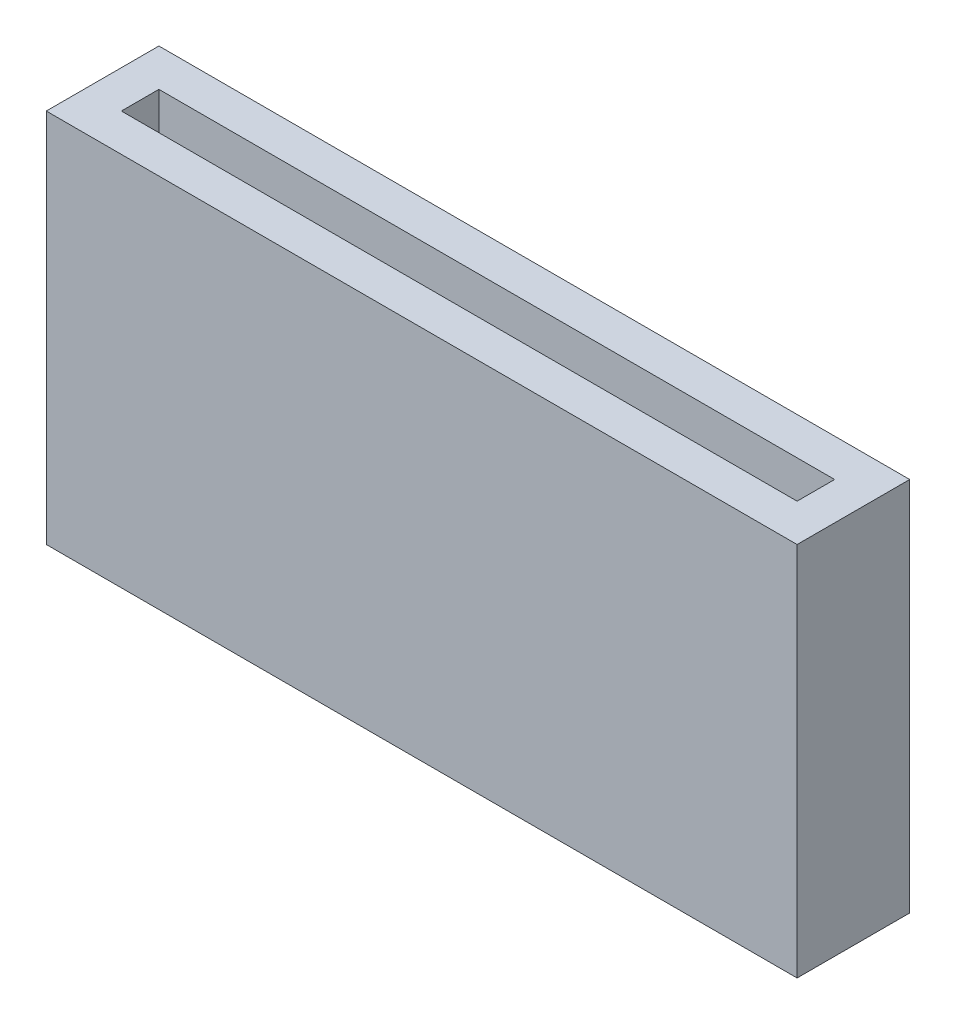
ISO-10303-21;
HEADER;
FILE_DESCRIPTION(('STEP AP214'),'2;1');
FILE_NAME('part.step','',(''),(''),'','','');
FILE_SCHEMA(('AUTOMOTIVE_DESIGN { 1 0 10303 214 1 1 1 1 }'));
ENDSEC;
DATA;
#1=APPLICATION_CONTEXT('core data for automotive mechanical design processes');
#2=APPLICATION_PROTOCOL_DEFINITION('international standard','automotive_design',2000,#1);
#3=PRODUCT_CONTEXT('',#1,'mechanical');
#4=PRODUCT('Part','Part','',(#3));
#5=PRODUCT_RELATED_PRODUCT_CATEGORY('part','',(#4));
#6=PRODUCT_DEFINITION_FORMATION('','',#4);
#7=PRODUCT_DEFINITION_CONTEXT('part definition',#1,'design');
#8=PRODUCT_DEFINITION('design','',#6,#7);
#9=PRODUCT_DEFINITION_SHAPE('','',#8);
#10=(LENGTH_UNIT() NAMED_UNIT(*) SI_UNIT(.MILLI.,.METRE.));
#11=(NAMED_UNIT(*) PLANE_ANGLE_UNIT() SI_UNIT($,.RADIAN.));
#12=(NAMED_UNIT(*) SI_UNIT($,.STERADIAN.) SOLID_ANGLE_UNIT());
#13=UNCERTAINTY_MEASURE_WITH_UNIT(LENGTH_MEASURE(1.E-05),#10,'distance_accuracy_value','');
#14=(GEOMETRIC_REPRESENTATION_CONTEXT(3) GLOBAL_UNCERTAINTY_ASSIGNED_CONTEXT((#13)) GLOBAL_UNIT_ASSIGNED_CONTEXT((#10,
#11,#12)) REPRESENTATION_CONTEXT('',''));
#15=CARTESIAN_POINT('',(0.,0.,0.));
#16=DIRECTION('',(0.,0.,1.));
#17=DIRECTION('',(1.,0.,0.));
#18=AXIS2_PLACEMENT_3D('',#15,#16,#17);
#19=CARTESIAN_POINT('',(-3.6,2.,1.2));
#20=DIRECTION('',(-1.,0.,0.));
#21=DIRECTION('',(0.,-1.,0.));
#22=AXIS2_PLACEMENT_3D('',#19,#20,#21);
#23=PLANE('',#22);
#24=DIRECTION('',(0.,1.,0.));
#25=VECTOR('',#24,1.);
#26=CARTESIAN_POINT('',(-3.6,2.,0.8));
#27=LINE('',#26,#25);
#28=CARTESIAN_POINT('',(-3.6,-2.,0.8));
#29=VERTEX_POINT('',#28);
#30=CARTESIAN_POINT('',(-3.6,2.,0.8));
#31=VERTEX_POINT('',#30);
#32=EDGE_CURVE('E292',#29,#31,#27,.T.);
#33=ORIENTED_EDGE('',*,*,#32,.F.);
#34=DIRECTION('',(0.,0.,-1.));
#35=VECTOR('',#34,1.);
#36=CARTESIAN_POINT('',(-3.6,-2.,1.2));
#37=LINE('',#36,#35);
#38=CARTESIAN_POINT('',(-3.6,-2.,0.4));
#39=VERTEX_POINT('',#38);
#40=EDGE_CURVE('E115',#29,#39,#37,.T.);
#41=ORIENTED_EDGE('',*,*,#40,.T.);
#42=DIRECTION('',(0.,1.,0.));
#43=VECTOR('',#42,1.);
#44=CARTESIAN_POINT('',(-3.6,2.,0.4));
#45=LINE('',#44,#43);
#46=CARTESIAN_POINT('',(-3.6,2.,0.4));
#47=VERTEX_POINT('',#46);
#48=EDGE_CURVE('E121',#39,#47,#45,.T.);
#49=ORIENTED_EDGE('',*,*,#48,.T.);
#50=DIRECTION('',(0.,0.,-1.));
#51=VECTOR('',#50,1.);
#52=CARTESIAN_POINT('',(-3.6,2.,1.2));
#53=LINE('',#52,#51);
#54=EDGE_CURVE('E135',#31,#47,#53,.T.);
#55=ORIENTED_EDGE('',*,*,#54,.F.);
#56=EDGE_LOOP('',(#33,#41,#49,#55));
#57=FACE_BOUND('',#56,.T.);
#58=ADVANCED_FACE('F38',(#57),#23,.F.);
#59=CARTESIAN_POINT('',(3.6,2.,1.2));
#60=DIRECTION('',(1.,0.,0.));
#61=DIRECTION('',(0.,1.,0.));
#62=AXIS2_PLACEMENT_3D('',#59,#60,#61);
#63=PLANE('',#62);
#64=DIRECTION('',(0.,1.,0.));
#65=VECTOR('',#64,1.);
#66=CARTESIAN_POINT('',(3.6,2.,0.8));
#67=LINE('',#66,#65);
#68=CARTESIAN_POINT('',(3.6,-2.,0.8));
#69=VERTEX_POINT('',#68);
#70=CARTESIAN_POINT('',(3.6,2.,0.8));
#71=VERTEX_POINT('',#70);
#72=EDGE_CURVE('E105',#69,#71,#67,.T.);
#73=ORIENTED_EDGE('',*,*,#72,.T.);
#74=DIRECTION('',(0.,0.,-1.));
#75=VECTOR('',#74,1.);
#76=CARTESIAN_POINT('',(3.6,2.,1.2));
#77=LINE('',#76,#75);
#78=CARTESIAN_POINT('',(3.6,2.,0.4));
#79=VERTEX_POINT('',#78);
#80=EDGE_CURVE('E53',#71,#79,#77,.T.);
#81=ORIENTED_EDGE('',*,*,#80,.T.);
#82=DIRECTION('',(0.,-1.,0.));
#83=VECTOR('',#82,1.);
#84=CARTESIAN_POINT('',(3.6,2.,0.4));
#85=LINE('',#84,#83);
#86=CARTESIAN_POINT('',(3.6,-2.,0.4));
#87=VERTEX_POINT('',#86);
#88=EDGE_CURVE('E118',#79,#87,#85,.T.);
#89=ORIENTED_EDGE('',*,*,#88,.T.);
#90=DIRECTION('',(0.,0.,-1.));
#91=VECTOR('',#90,1.);
#92=CARTESIAN_POINT('',(3.6,-2.,1.2));
#93=LINE('',#92,#91);
#94=EDGE_CURVE('E61',#69,#87,#93,.T.);
#95=ORIENTED_EDGE('',*,*,#94,.F.);
#96=EDGE_LOOP('',(#73,#81,#89,#95));
#97=FACE_BOUND('',#96,.T.);
#98=ADVANCED_FACE('F117',(#97),#63,.F.);
#99=CARTESIAN_POINT('',(0.,0.,0.4));
#100=DIRECTION('',(0.,0.,1.));
#101=DIRECTION('',(1.,0.,0.));
#102=AXIS2_PLACEMENT_3D('',#99,#100,#101);
#103=PLANE('',#102);
#104=DIRECTION('',(1.,0.,0.));
#105=VECTOR('',#104,1.);
#106=CARTESIAN_POINT('',(-4.,-2.,0.4));
#107=LINE('',#106,#105);
#108=EDGE_CURVE('E144',#39,#87,#107,.T.);
#109=ORIENTED_EDGE('',*,*,#108,.T.);
#110=ORIENTED_EDGE('',*,*,#88,.F.);
#111=DIRECTION('',(-1.,0.,0.));
#112=VECTOR('',#111,1.);
#113=CARTESIAN_POINT('',(-4.,2.,0.4));
#114=LINE('',#113,#112);
#115=EDGE_CURVE('E141',#79,#47,#114,.T.);
#116=ORIENTED_EDGE('',*,*,#115,.T.);
#117=ORIENTED_EDGE('',*,*,#48,.F.);
#118=EDGE_LOOP('',(#109,#110,#116,#117));
#119=FACE_BOUND('',#118,.T.);
#120=ADVANCED_FACE('F186',(#119),#103,.T.);
#121=CARTESIAN_POINT('',(4.,2.,0.4));
#122=DIRECTION('',(-1.,0.,0.));
#123=DIRECTION('',(0.,-1.,0.));
#124=AXIS2_PLACEMENT_3D('',#121,#122,#123);
#125=PLANE('',#124);
#126=DIRECTION('',(0.,1.,0.));
#127=VECTOR('',#126,1.);
#128=CARTESIAN_POINT('',(4.,2.,0.));
#129=LINE('',#128,#127);
#130=CARTESIAN_POINT('',(4.,-2.,0.));
#131=VERTEX_POINT('',#130);
#132=CARTESIAN_POINT('',(4.,2.,0.));
#133=VERTEX_POINT('',#132);
#134=EDGE_CURVE('E140',#131,#133,#129,.T.);
#135=ORIENTED_EDGE('',*,*,#134,.T.);
#136=DIRECTION('',(0.,0.,-1.));
#137=VECTOR('',#136,1.);
#138=CARTESIAN_POINT('',(4.,2.,0.4));
#139=LINE('',#138,#137);
#140=CARTESIAN_POINT('',(4.,2.,1.2));
#141=VERTEX_POINT('',#140);
#142=EDGE_CURVE('E11',#141,#133,#139,.T.);
#143=ORIENTED_EDGE('',*,*,#142,.F.);
#144=DIRECTION('',(0.,1.,0.));
#145=VECTOR('',#144,1.);
#146=CARTESIAN_POINT('',(4.,2.,1.2));
#147=LINE('',#146,#145);
#148=CARTESIAN_POINT('',(4.,-2.,1.2));
#149=VERTEX_POINT('',#148);
#150=EDGE_CURVE('E119',#149,#141,#147,.T.);
#151=ORIENTED_EDGE('',*,*,#150,.F.);
#152=DIRECTION('',(0.,0.,-1.));
#153=VECTOR('',#152,1.);
#154=CARTESIAN_POINT('',(4.,-2.,0.4));
#155=LINE('',#154,#153);
#156=EDGE_CURVE('E147',#149,#131,#155,.T.);
#157=ORIENTED_EDGE('',*,*,#156,.T.);
#158=EDGE_LOOP('',(#135,#143,#151,#157));
#159=FACE_BOUND('',#158,.T.);
#160=ADVANCED_FACE('F40',(#159),#125,.F.);
#161=CARTESIAN_POINT('',(-4.,2.,0.4));
#162=DIRECTION('',(0.,-1.,0.));
#163=DIRECTION('',(0.,0.,-1.));
#164=AXIS2_PLACEMENT_3D('',#161,#162,#163);
#165=PLANE('',#164);
#166=DIRECTION('',(-1.,0.,0.));
#167=VECTOR('',#166,1.);
#168=CARTESIAN_POINT('',(4.002,2.,0.8));
#169=LINE('',#168,#167);
#170=EDGE_CURVE('E110',#71,#31,#169,.T.);
#171=ORIENTED_EDGE('',*,*,#170,.T.);
#172=ORIENTED_EDGE('',*,*,#54,.T.);
#173=ORIENTED_EDGE('',*,*,#115,.F.);
#174=ORIENTED_EDGE('',*,*,#80,.F.);
#175=EDGE_LOOP('',(#171,#172,#173,#174));
#176=FACE_BOUND('',#175,.T.);
#177=DIRECTION('',(-1.,0.,0.));
#178=VECTOR('',#177,1.);
#179=CARTESIAN_POINT('',(-4.,2.,0.));
#180=LINE('',#179,#178);
#181=CARTESIAN_POINT('',(-4.,2.,0.));
#182=VERTEX_POINT('',#181);
#183=EDGE_CURVE('E150',#133,#182,#180,.T.);
#184=ORIENTED_EDGE('',*,*,#183,.T.);
#185=DIRECTION('',(0.,0.,-1.));
#186=VECTOR('',#185,1.);
#187=CARTESIAN_POINT('',(-4.,2.,0.4));
#188=LINE('',#187,#186);
#189=CARTESIAN_POINT('',(-4.,2.,1.2));
#190=VERTEX_POINT('',#189);
#191=EDGE_CURVE('E46',#190,#182,#188,.T.);
#192=ORIENTED_EDGE('',*,*,#191,.F.);
#193=DIRECTION('',(-1.,0.,0.));
#194=VECTOR('',#193,1.);
#195=CARTESIAN_POINT('',(-4.,2.,1.2));
#196=LINE('',#195,#194);
#197=EDGE_CURVE('E132',#141,#190,#196,.T.);
#198=ORIENTED_EDGE('',*,*,#197,.F.);
#199=ORIENTED_EDGE('',*,*,#142,.T.);
#200=EDGE_LOOP('',(#184,#192,#198,#199));
#201=FACE_BOUND('',#200,.T.);
#202=ADVANCED_FACE('F176',(#176,#201),#165,.F.);
#203=CARTESIAN_POINT('',(-4.,2.,0.4));
#204=DIRECTION('',(1.,0.,0.));
#205=DIRECTION('',(0.,1.,0.));
#206=AXIS2_PLACEMENT_3D('',#203,#204,#205);
#207=PLANE('',#206);
#208=DIRECTION('',(0.,-1.,0.));
#209=VECTOR('',#208,1.);
#210=CARTESIAN_POINT('',(-4.,2.,0.));
#211=LINE('',#210,#209);
#212=CARTESIAN_POINT('',(-4.,-2.,0.));
#213=VERTEX_POINT('',#212);
#214=EDGE_CURVE('E152',#182,#213,#211,.T.);
#215=ORIENTED_EDGE('',*,*,#214,.T.);
#216=DIRECTION('',(0.,0.,-1.));
#217=VECTOR('',#216,1.);
#218=CARTESIAN_POINT('',(-4.,-2.,0.4));
#219=LINE('',#218,#217);
#220=CARTESIAN_POINT('',(-4.,-2.,1.2));
#221=VERTEX_POINT('',#220);
#222=EDGE_CURVE('E157',#221,#213,#219,.T.);
#223=ORIENTED_EDGE('',*,*,#222,.F.);
#224=DIRECTION('',(0.,-1.,0.));
#225=VECTOR('',#224,1.);
#226=CARTESIAN_POINT('',(-4.,2.,1.2));
#227=LINE('',#226,#225);
#228=EDGE_CURVE('E127',#190,#221,#227,.T.);
#229=ORIENTED_EDGE('',*,*,#228,.F.);
#230=ORIENTED_EDGE('',*,*,#191,.T.);
#231=EDGE_LOOP('',(#215,#223,#229,#230));
#232=FACE_BOUND('',#231,.T.);
#233=ADVANCED_FACE('F163',(#232),#207,.F.);
#234=CARTESIAN_POINT('',(-4.,-2.,0.4));
#235=DIRECTION('',(0.,1.,0.));
#236=DIRECTION('',(0.,0.,1.));
#237=AXIS2_PLACEMENT_3D('',#234,#235,#236);
#238=PLANE('',#237);
#239=ORIENTED_EDGE('',*,*,#40,.F.);
#240=DIRECTION('',(-1.,0.,0.));
#241=VECTOR('',#240,1.);
#242=CARTESIAN_POINT('',(4.002,-2.,0.8));
#243=LINE('',#242,#241);
#244=EDGE_CURVE('E108',#69,#29,#243,.T.);
#245=ORIENTED_EDGE('',*,*,#244,.F.);
#246=ORIENTED_EDGE('',*,*,#94,.T.);
#247=ORIENTED_EDGE('',*,*,#108,.F.);
#248=EDGE_LOOP('',(#239,#245,#246,#247));
#249=FACE_BOUND('',#248,.T.);
#250=DIRECTION('',(1.,0.,0.));
#251=VECTOR('',#250,1.);
#252=CARTESIAN_POINT('',(-4.,-2.,0.));
#253=LINE('',#252,#251);
#254=EDGE_CURVE('E145',#213,#131,#253,.T.);
#255=ORIENTED_EDGE('',*,*,#254,.T.);
#256=ORIENTED_EDGE('',*,*,#156,.F.);
#257=DIRECTION('',(1.,0.,0.));
#258=VECTOR('',#257,1.);
#259=CARTESIAN_POINT('',(-4.,-2.,1.2));
#260=LINE('',#259,#258);
#261=EDGE_CURVE('E130',#221,#149,#260,.T.);
#262=ORIENTED_EDGE('',*,*,#261,.F.);
#263=ORIENTED_EDGE('',*,*,#222,.T.);
#264=EDGE_LOOP('',(#255,#256,#262,#263));
#265=FACE_BOUND('',#264,.T.);
#266=ADVANCED_FACE('F113',(#249,#265),#238,.F.);
#267=CARTESIAN_POINT('',(0.,0.,0.));
#268=DIRECTION('',(0.,0.,1.));
#269=DIRECTION('',(1.,0.,0.));
#270=AXIS2_PLACEMENT_3D('',#267,#268,#269);
#271=PLANE('',#270);
#272=ORIENTED_EDGE('',*,*,#134,.F.);
#273=ORIENTED_EDGE('',*,*,#254,.F.);
#274=ORIENTED_EDGE('',*,*,#214,.F.);
#275=ORIENTED_EDGE('',*,*,#183,.F.);
#276=EDGE_LOOP('',(#272,#273,#274,#275));
#277=FACE_BOUND('',#276,.T.);
#278=ADVANCED_FACE('F168',(#277),#271,.F.);
#279=CARTESIAN_POINT('',(0.,0.,1.2));
#280=DIRECTION('',(0.,0.,1.));
#281=DIRECTION('',(1.,0.,0.));
#282=AXIS2_PLACEMENT_3D('',#279,#280,#281);
#283=PLANE('',#282);
#284=ORIENTED_EDGE('',*,*,#228,.T.);
#285=ORIENTED_EDGE('',*,*,#261,.T.);
#286=ORIENTED_EDGE('',*,*,#150,.T.);
#287=ORIENTED_EDGE('',*,*,#197,.T.);
#288=EDGE_LOOP('',(#284,#285,#286,#287));
#289=FACE_BOUND('',#288,.T.);
#290=ADVANCED_FACE('F175',(#289),#283,.T.);
#291=CARTESIAN_POINT('',(4.002,2.,0.8));
#292=DIRECTION('',(0.,0.,1.));
#293=DIRECTION('',(0.,-1.,0.));
#294=AXIS2_PLACEMENT_3D('',#291,#292,#293);
#295=PLANE('',#294);
#296=ORIENTED_EDGE('',*,*,#72,.F.);
#297=ORIENTED_EDGE('',*,*,#244,.T.);
#298=ORIENTED_EDGE('',*,*,#32,.T.);
#299=ORIENTED_EDGE('',*,*,#170,.F.);
#300=EDGE_LOOP('',(#296,#297,#298,#299));
#301=FACE_BOUND('',#300,.T.);
#302=ADVANCED_FACE('F106',(#301),#295,.F.);
#303=CLOSED_SHELL('',(#58,#98,#120,#160,#202,#233,#266,#278,#290,#302));
#304=MANIFOLD_SOLID_BREP('B2',#303);
#305=ADVANCED_BREP_SHAPE_REPRESENTATION('',(#18,#304),#14);
#306=SHAPE_DEFINITION_REPRESENTATION(#9,#305);
ENDSEC;
END-ISO-10303-21;
